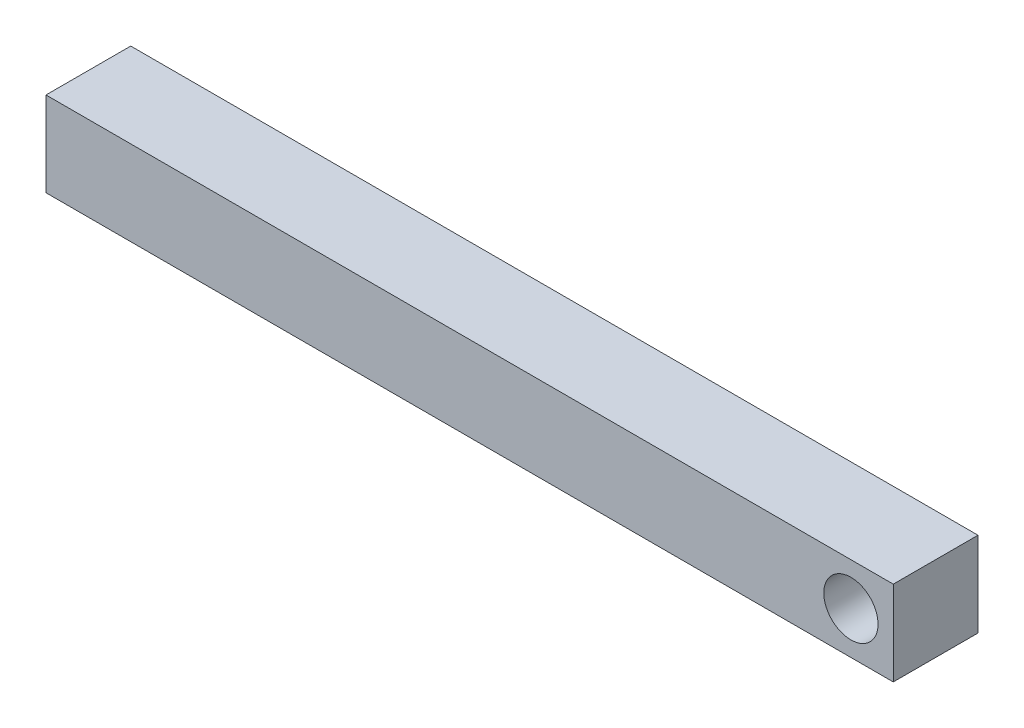
ISO-10303-21;
HEADER;
FILE_DESCRIPTION(('STEP AP214'),'2;1');
FILE_NAME('part.step','',(''),(''),'','','');
FILE_SCHEMA(('AUTOMOTIVE_DESIGN { 1 0 10303 214 1 1 1 1 }'));
ENDSEC;
DATA;
#1=APPLICATION_CONTEXT('core data for automotive mechanical design processes');
#2=APPLICATION_PROTOCOL_DEFINITION('international standard','automotive_design',2000,#1);
#3=PRODUCT_CONTEXT('',#1,'mechanical');
#4=PRODUCT('Part','Part','',(#3));
#5=PRODUCT_RELATED_PRODUCT_CATEGORY('part','',(#4));
#6=PRODUCT_DEFINITION_FORMATION('','',#4);
#7=PRODUCT_DEFINITION_CONTEXT('part definition',#1,'design');
#8=PRODUCT_DEFINITION('design','',#6,#7);
#9=PRODUCT_DEFINITION_SHAPE('','',#8);
#10=(LENGTH_UNIT() NAMED_UNIT(*) SI_UNIT(.MILLI.,.METRE.));
#11=(NAMED_UNIT(*) PLANE_ANGLE_UNIT() SI_UNIT($,.RADIAN.));
#12=(NAMED_UNIT(*) SI_UNIT($,.STERADIAN.) SOLID_ANGLE_UNIT());
#13=UNCERTAINTY_MEASURE_WITH_UNIT(LENGTH_MEASURE(1.E-05),#10,'distance_accuracy_value','');
#14=(GEOMETRIC_REPRESENTATION_CONTEXT(3) GLOBAL_UNCERTAINTY_ASSIGNED_CONTEXT((#13)) GLOBAL_UNIT_ASSIGNED_CONTEXT((#10,
#11,#12)) REPRESENTATION_CONTEXT('',''));
#15=CARTESIAN_POINT('',(0.,0.,0.));
#16=DIRECTION('',(0.,0.,1.));
#17=DIRECTION('',(1.,0.,0.));
#18=AXIS2_PLACEMENT_3D('',#15,#16,#17);
#19=CARTESIAN_POINT('',(0.,25.,0.));
#20=DIRECTION('',(1.,0.,0.));
#21=DIRECTION('',(0.,0.,-1.));
#22=AXIS2_PLACEMENT_3D('',#19,#20,#21);
#23=PLANE('',#22);
#24=DIRECTION('',(0.,0.,1.));
#25=VECTOR('',#24,1.);
#26=CARTESIAN_POINT('',(0.,0.,0.));
#27=LINE('',#26,#25);
#28=CARTESIAN_POINT('',(0.,0.,-25.));
#29=VERTEX_POINT('',#28);
#30=CARTESIAN_POINT('',(0.,0.,0.));
#31=VERTEX_POINT('',#30);
#32=EDGE_CURVE('E100',#29,#31,#27,.T.);
#33=ORIENTED_EDGE('',*,*,#32,.T.);
#34=DIRECTION('',(0.,-1.,0.));
#35=VECTOR('',#34,1.);
#36=CARTESIAN_POINT('',(0.,25.,0.));
#37=LINE('',#36,#35);
#38=CARTESIAN_POINT('',(0.,25.,0.));
#39=VERTEX_POINT('',#38);
#40=EDGE_CURVE('E11',#39,#31,#37,.T.);
#41=ORIENTED_EDGE('',*,*,#40,.F.);
#42=DIRECTION('',(0.,0.,1.));
#43=VECTOR('',#42,1.);
#44=CARTESIAN_POINT('',(0.,25.,0.));
#45=LINE('',#44,#43);
#46=CARTESIAN_POINT('',(0.,25.,-25.));
#47=VERTEX_POINT('',#46);
#48=EDGE_CURVE('E88',#47,#39,#45,.T.);
#49=ORIENTED_EDGE('',*,*,#48,.F.);
#50=DIRECTION('',(0.,-1.,0.));
#51=VECTOR('',#50,1.);
#52=CARTESIAN_POINT('',(0.,25.,-25.));
#53=LINE('',#52,#51);
#54=EDGE_CURVE('E96',#47,#29,#53,.T.);
#55=ORIENTED_EDGE('',*,*,#54,.T.);
#56=EDGE_LOOP('',(#33,#41,#49,#55));
#57=FACE_BOUND('',#56,.T.);
#58=ADVANCED_FACE('F37',(#57),#23,.F.);
#59=CARTESIAN_POINT('',(0.,25.,0.));
#60=DIRECTION('',(0.,0.,-1.));
#61=DIRECTION('',(-1.,0.,0.));
#62=AXIS2_PLACEMENT_3D('',#59,#60,#61);
#63=PLANE('',#62);
#64=CARTESIAN_POINT('',(237.5,12.5,0.));
#65=DIRECTION('',(0.,0.,1.));
#66=DIRECTION('',(1.,0.,0.));
#67=AXIS2_PLACEMENT_3D('',#64,#65,#66);
#68=CIRCLE('',#67,8.00000000000001);
#69=CARTESIAN_POINT('',(245.5,12.5,0.));
#70=VERTEX_POINT('',#69);
#71=EDGE_CURVE('E114',#70,#70,#68,.T.);
#72=ORIENTED_EDGE('',*,*,#71,.F.);
#73=EDGE_LOOP('',(#72));
#74=FACE_BOUND('',#73,.T.);
#75=DIRECTION('',(1.,0.,0.));
#76=VECTOR('',#75,1.);
#77=CARTESIAN_POINT('',(0.,0.,0.));
#78=LINE('',#77,#76);
#79=CARTESIAN_POINT('',(250.,0.,0.));
#80=VERTEX_POINT('',#79);
#81=EDGE_CURVE('E92',#31,#80,#78,.T.);
#82=ORIENTED_EDGE('',*,*,#81,.T.);
#83=DIRECTION('',(0.,-1.,0.));
#84=VECTOR('',#83,1.);
#85=CARTESIAN_POINT('',(250.,25.,0.));
#86=LINE('',#85,#84);
#87=CARTESIAN_POINT('',(250.,25.,0.));
#88=VERTEX_POINT('',#87);
#89=EDGE_CURVE('E45',#88,#80,#86,.T.);
#90=ORIENTED_EDGE('',*,*,#89,.F.);
#91=DIRECTION('',(1.,0.,0.));
#92=VECTOR('',#91,1.);
#93=CARTESIAN_POINT('',(0.,25.,0.));
#94=LINE('',#93,#92);
#95=EDGE_CURVE('E83',#39,#88,#94,.T.);
#96=ORIENTED_EDGE('',*,*,#95,.F.);
#97=ORIENTED_EDGE('',*,*,#40,.T.);
#98=EDGE_LOOP('',(#82,#90,#96,#97));
#99=FACE_BOUND('',#98,.T.);
#100=ADVANCED_FACE('F91',(#74,#99),#63,.F.);
#101=CARTESIAN_POINT('',(250.,25.,0.));
#102=DIRECTION('',(-1.,0.,0.));
#103=DIRECTION('',(0.,0.,1.));
#104=AXIS2_PLACEMENT_3D('',#101,#102,#103);
#105=PLANE('',#104);
#106=DIRECTION('',(0.,0.,-1.));
#107=VECTOR('',#106,1.);
#108=CARTESIAN_POINT('',(250.,0.,0.));
#109=LINE('',#108,#107);
#110=CARTESIAN_POINT('',(250.,0.,-25.));
#111=VERTEX_POINT('',#110);
#112=EDGE_CURVE('E70',#80,#111,#109,.T.);
#113=ORIENTED_EDGE('',*,*,#112,.T.);
#114=DIRECTION('',(0.,-1.,0.));
#115=VECTOR('',#114,1.);
#116=CARTESIAN_POINT('',(250.,25.,-25.));
#117=LINE('',#116,#115);
#118=CARTESIAN_POINT('',(250.,25.,-25.));
#119=VERTEX_POINT('',#118);
#120=EDGE_CURVE('E93',#119,#111,#117,.T.);
#121=ORIENTED_EDGE('',*,*,#120,.F.);
#122=DIRECTION('',(0.,0.,-1.));
#123=VECTOR('',#122,1.);
#124=CARTESIAN_POINT('',(250.,25.,0.));
#125=LINE('',#124,#123);
#126=EDGE_CURVE('E86',#88,#119,#125,.T.);
#127=ORIENTED_EDGE('',*,*,#126,.F.);
#128=ORIENTED_EDGE('',*,*,#89,.T.);
#129=EDGE_LOOP('',(#113,#121,#127,#128));
#130=FACE_BOUND('',#129,.T.);
#131=ADVANCED_FACE('F94',(#130),#105,.F.);
#132=CARTESIAN_POINT('',(0.,25.,-25.));
#133=DIRECTION('',(0.,0.,1.));
#134=DIRECTION('',(1.,0.,0.));
#135=AXIS2_PLACEMENT_3D('',#132,#133,#134);
#136=PLANE('',#135);
#137=CARTESIAN_POINT('',(237.5,12.5,-25.));
#138=DIRECTION('',(0.,0.,1.));
#139=DIRECTION('',(1.,0.,0.));
#140=AXIS2_PLACEMENT_3D('',#137,#138,#139);
#141=CIRCLE('',#140,8.00000000000001);
#142=CARTESIAN_POINT('',(245.5,12.5,-25.));
#143=VERTEX_POINT('',#142);
#144=EDGE_CURVE('E103',#143,#143,#141,.T.);
#145=ORIENTED_EDGE('',*,*,#144,.T.);
#146=EDGE_LOOP('',(#145));
#147=FACE_BOUND('',#146,.T.);
#148=DIRECTION('',(-1.,0.,0.));
#149=VECTOR('',#148,1.);
#150=CARTESIAN_POINT('',(0.,0.,-25.));
#151=LINE('',#150,#149);
#152=EDGE_CURVE('E76',#111,#29,#151,.T.);
#153=ORIENTED_EDGE('',*,*,#152,.T.);
#154=ORIENTED_EDGE('',*,*,#54,.F.);
#155=DIRECTION('',(-1.,0.,0.));
#156=VECTOR('',#155,1.);
#157=CARTESIAN_POINT('',(0.,25.,-25.));
#158=LINE('',#157,#156);
#159=EDGE_CURVE('E53',#119,#47,#158,.T.);
#160=ORIENTED_EDGE('',*,*,#159,.F.);
#161=ORIENTED_EDGE('',*,*,#120,.T.);
#162=EDGE_LOOP('',(#153,#154,#160,#161));
#163=FACE_BOUND('',#162,.T.);
#164=ADVANCED_FACE('F108',(#147,#163),#136,.F.);
#165=CARTESIAN_POINT('',(0.,25.,0.));
#166=DIRECTION('',(0.,-1.,0.));
#167=DIRECTION('',(0.,0.,-1.));
#168=AXIS2_PLACEMENT_3D('',#165,#166,#167);
#169=PLANE('',#168);
#170=ORIENTED_EDGE('',*,*,#48,.T.);
#171=ORIENTED_EDGE('',*,*,#95,.T.);
#172=ORIENTED_EDGE('',*,*,#126,.T.);
#173=ORIENTED_EDGE('',*,*,#159,.T.);
#174=EDGE_LOOP('',(#170,#171,#172,#173));
#175=FACE_BOUND('',#174,.T.);
#176=ADVANCED_FACE('F84',(#175),#169,.F.);
#177=CARTESIAN_POINT('',(0.,0.,0.));
#178=DIRECTION('',(0.,-1.,0.));
#179=DIRECTION('',(0.,0.,-1.));
#180=AXIS2_PLACEMENT_3D('',#177,#178,#179);
#181=PLANE('',#180);
#182=ORIENTED_EDGE('',*,*,#32,.F.);
#183=ORIENTED_EDGE('',*,*,#152,.F.);
#184=ORIENTED_EDGE('',*,*,#112,.F.);
#185=ORIENTED_EDGE('',*,*,#81,.F.);
#186=EDGE_LOOP('',(#182,#183,#184,#185));
#187=FACE_BOUND('',#186,.T.);
#188=ADVANCED_FACE('F111',(#187),#181,.T.);
#189=CARTESIAN_POINT('',(237.5,12.5,-25.));
#190=DIRECTION('',(0.,0.,1.));
#191=DIRECTION('',(1.,0.,0.));
#192=AXIS2_PLACEMENT_3D('',#189,#190,#191);
#193=CYLINDRICAL_SURFACE('',#192,8.00000000000001);
#194=ORIENTED_EDGE('',*,*,#144,.F.);
#195=EDGE_LOOP('',(#194));
#196=FACE_BOUND('',#195,.T.);
#197=ORIENTED_EDGE('',*,*,#71,.T.);
#198=EDGE_LOOP('',(#197));
#199=FACE_BOUND('',#198,.T.);
#200=ADVANCED_FACE('F121',(#196,#199),#193,.F.);
#201=CLOSED_SHELL('',(#58,#100,#131,#164,#176,#188,#200));
#202=MANIFOLD_SOLID_BREP('B2',#201);
#203=ADVANCED_BREP_SHAPE_REPRESENTATION('',(#18,#202),#14);
#204=SHAPE_DEFINITION_REPRESENTATION(#9,#203);
ENDSEC;
END-ISO-10303-21;
